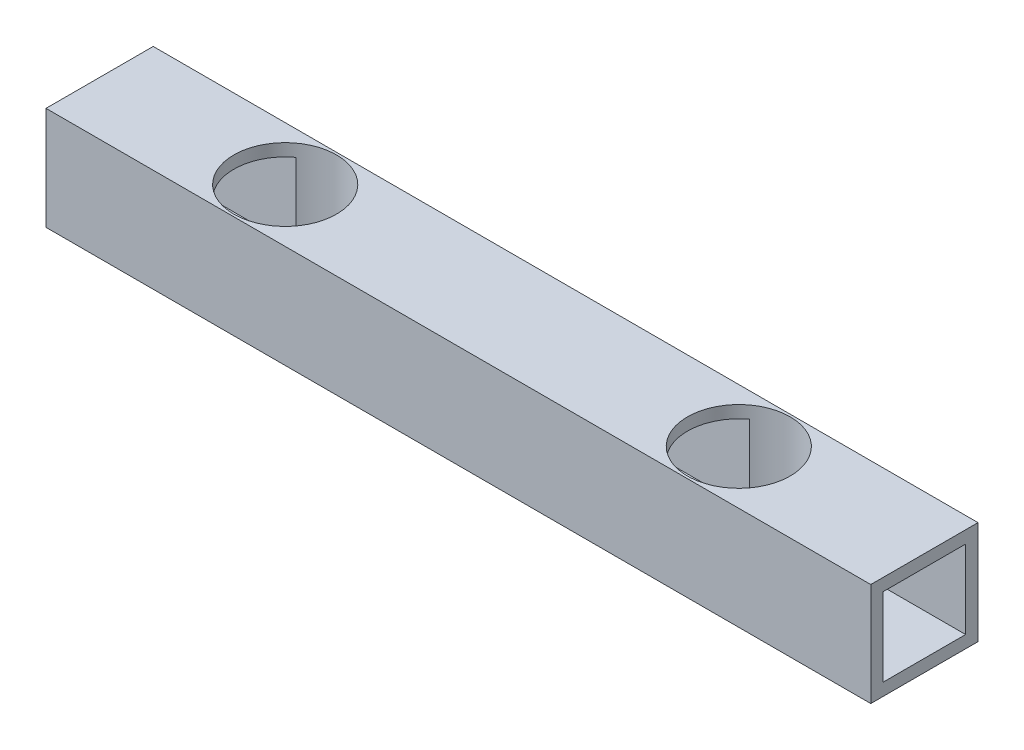
ISO-10303-21;
HEADER;
FILE_DESCRIPTION(('STEP AP214'),'2;1');
FILE_NAME('part.step','',(''),(''),'','','');
FILE_SCHEMA(('AUTOMOTIVE_DESIGN { 1 0 10303 214 1 1 1 1 }'));
ENDSEC;
DATA;
#1=APPLICATION_CONTEXT('core data for automotive mechanical design processes');
#2=APPLICATION_PROTOCOL_DEFINITION('international standard','automotive_design',2000,#1);
#3=PRODUCT_CONTEXT('',#1,'mechanical');
#4=PRODUCT('Part','Part','',(#3));
#5=PRODUCT_RELATED_PRODUCT_CATEGORY('part','',(#4));
#6=PRODUCT_DEFINITION_FORMATION('','',#4);
#7=PRODUCT_DEFINITION_CONTEXT('part definition',#1,'design');
#8=PRODUCT_DEFINITION('design','',#6,#7);
#9=PRODUCT_DEFINITION_SHAPE('','',#8);
#10=(LENGTH_UNIT() NAMED_UNIT(*) SI_UNIT(.MILLI.,.METRE.));
#11=(NAMED_UNIT(*) PLANE_ANGLE_UNIT() SI_UNIT($,.RADIAN.));
#12=(NAMED_UNIT(*) SI_UNIT($,.STERADIAN.) SOLID_ANGLE_UNIT());
#13=UNCERTAINTY_MEASURE_WITH_UNIT(LENGTH_MEASURE(1.E-05),#10,'distance_accuracy_value','');
#14=(GEOMETRIC_REPRESENTATION_CONTEXT(3) GLOBAL_UNCERTAINTY_ASSIGNED_CONTEXT((#13)) GLOBAL_UNIT_ASSIGNED_CONTEXT((#10,
#11,#12)) REPRESENTATION_CONTEXT('',''));
#15=CARTESIAN_POINT('',(0.,0.,0.));
#16=DIRECTION('',(0.,0.,1.));
#17=DIRECTION('',(1.,0.,0.));
#18=AXIS2_PLACEMENT_3D('',#15,#16,#17);
#19=CARTESIAN_POINT('',(-100.,25.,-9.99999999999999));
#20=DIRECTION('',(0.,0.,1.));
#21=DIRECTION('',(1.,0.,0.));
#22=AXIS2_PLACEMENT_3D('',#19,#20,#21);
#23=PLANE('',#22);
#24=DIRECTION('',(0.,1.,0.));
#25=VECTOR('',#24,1.);
#26=CARTESIAN_POINT('',(62.416367035146,0.,-9.99999999999999));
#27=LINE('',#26,#25);
#28=CARTESIAN_POINT('',(62.416367035146,3.,-9.99999999999999));
#29=VERTEX_POINT('',#28);
#30=CARTESIAN_POINT('',(62.416367035146,22.,-9.99999999999999));
#31=VERTEX_POINT('',#30);
#32=EDGE_CURVE('E274',#29,#31,#27,.T.);
#33=ORIENTED_EDGE('',*,*,#32,.F.);
#34=DIRECTION('',(-1.,0.,0.));
#35=VECTOR('',#34,1.);
#36=CARTESIAN_POINT('',(-100.,3.,-9.99999999999999));
#37=LINE('',#36,#35);
#38=CARTESIAN_POINT('',(100.,3.,-9.99999999999999));
#39=VERTEX_POINT('',#38);
#40=EDGE_CURVE('E159',#39,#29,#37,.T.);
#41=ORIENTED_EDGE('',*,*,#40,.F.);
#42=DIRECTION('',(0.,-1.,0.));
#43=VECTOR('',#42,1.);
#44=CARTESIAN_POINT('',(100.,25.,-9.99999999999999));
#45=LINE('',#44,#43);
#46=CARTESIAN_POINT('',(100.,22.,-9.99999999999999));
#47=VERTEX_POINT('',#46);
#48=EDGE_CURVE('E186',#47,#39,#45,.T.);
#49=ORIENTED_EDGE('',*,*,#48,.F.);
#50=DIRECTION('',(-1.,0.,0.));
#51=VECTOR('',#50,1.);
#52=CARTESIAN_POINT('',(-100.,22.,-9.99999999999999));
#53=LINE('',#52,#51);
#54=EDGE_CURVE('E204',#47,#31,#53,.T.);
#55=ORIENTED_EDGE('',*,*,#54,.T.);
#56=EDGE_LOOP('',(#33,#41,#49,#55));
#57=FACE_BOUND('',#56,.T.);
#58=ADVANCED_FACE('F35',(#57),#23,.T.);
#59=CARTESIAN_POINT('',(0.,22.,0.));
#60=DIRECTION('',(0.,1.,0.));
#61=DIRECTION('',(0.,0.,1.));
#62=AXIS2_PLACEMENT_3D('',#59,#60,#61);
#63=PLANE('',#62);
#64=DIRECTION('',(1.,0.,0.));
#65=VECTOR('',#64,1.);
#66=CARTESIAN_POINT('',(-100.,22.,10.));
#67=LINE('',#66,#65);
#68=CARTESIAN_POINT('',(62.4163670351459,22.,10.));
#69=VERTEX_POINT('',#68);
#70=CARTESIAN_POINT('',(100.,22.,10.));
#71=VERTEX_POINT('',#70);
#72=EDGE_CURVE('E202',#69,#71,#67,.T.);
#73=ORIENTED_EDGE('',*,*,#72,.F.);
#74=CARTESIAN_POINT('',(55.,22.,0.));
#75=DIRECTION('',(0.,1.,0.));
#76=DIRECTION('',(0.,0.,1.));
#77=AXIS2_PLACEMENT_3D('',#74,#75,#76);
#78=CIRCLE('',#77,12.45);
#79=EDGE_CURVE('E57',#69,#31,#78,.T.);
#80=ORIENTED_EDGE('',*,*,#79,.T.);
#81=ORIENTED_EDGE('',*,*,#54,.F.);
#82=DIRECTION('',(0.,0.,-1.));
#83=VECTOR('',#82,1.);
#84=CARTESIAN_POINT('',(100.,22.,-13.));
#85=LINE('',#84,#83);
#86=EDGE_CURVE('E190',#71,#47,#85,.T.);
#87=ORIENTED_EDGE('',*,*,#86,.F.);
#88=EDGE_LOOP('',(#73,#80,#81,#87));
#89=FACE_BOUND('',#88,.T.);
#90=ADVANCED_FACE('F327',(#89),#63,.F.);
#91=CARTESIAN_POINT('',(0.,3.,0.));
#92=DIRECTION('',(0.,1.,0.));
#93=DIRECTION('',(0.,0.,1.));
#94=AXIS2_PLACEMENT_3D('',#91,#92,#93);
#95=PLANE('',#94);
#96=CARTESIAN_POINT('',(55.,3.,0.));
#97=DIRECTION('',(0.,1.,0.));
#98=DIRECTION('',(0.,0.,1.));
#99=AXIS2_PLACEMENT_3D('',#96,#97,#98);
#100=CIRCLE('',#99,12.45);
#101=CARTESIAN_POINT('',(62.416367035146,3.,10.));
#102=VERTEX_POINT('',#101);
#103=EDGE_CURVE('E147',#102,#29,#100,.T.);
#104=ORIENTED_EDGE('',*,*,#103,.F.);
#105=DIRECTION('',(1.,0.,0.));
#106=VECTOR('',#105,1.);
#107=CARTESIAN_POINT('',(-100.,3.,10.));
#108=LINE('',#107,#106);
#109=CARTESIAN_POINT('',(100.,3.,10.));
#110=VERTEX_POINT('',#109);
#111=EDGE_CURVE('E156',#102,#110,#108,.T.);
#112=ORIENTED_EDGE('',*,*,#111,.T.);
#113=DIRECTION('',(0.,0.,-1.));
#114=VECTOR('',#113,1.);
#115=CARTESIAN_POINT('',(100.,3.,-13.));
#116=LINE('',#115,#114);
#117=EDGE_CURVE('E177',#110,#39,#116,.T.);
#118=ORIENTED_EDGE('',*,*,#117,.T.);
#119=ORIENTED_EDGE('',*,*,#40,.T.);
#120=EDGE_LOOP('',(#104,#112,#118,#119));
#121=FACE_BOUND('',#120,.T.);
#122=ADVANCED_FACE('F155',(#121),#95,.T.);
#123=CARTESIAN_POINT('',(-100.,25.,10.));
#124=DIRECTION('',(0.,0.,-1.));
#125=DIRECTION('',(-1.,0.,0.));
#126=AXIS2_PLACEMENT_3D('',#123,#124,#125);
#127=PLANE('',#126);
#128=DIRECTION('',(0.,1.,0.));
#129=VECTOR('',#128,1.);
#130=CARTESIAN_POINT('',(47.583632964854,0.,10.));
#131=LINE('',#130,#129);
#132=CARTESIAN_POINT('',(47.583632964854,3.,10.));
#133=VERTEX_POINT('',#132);
#134=CARTESIAN_POINT('',(47.583632964854,22.,10.));
#135=VERTEX_POINT('',#134);
#136=EDGE_CURVE('E11',#133,#135,#131,.T.);
#137=ORIENTED_EDGE('',*,*,#136,.F.);
#138=CARTESIAN_POINT('',(-47.583632964854,3.,10.));
#139=VERTEX_POINT('',#138);
#140=EDGE_CURVE('E166',#139,#133,#108,.T.);
#141=ORIENTED_EDGE('',*,*,#140,.F.);
#142=DIRECTION('',(0.,1.,0.));
#143=VECTOR('',#142,1.);
#144=CARTESIAN_POINT('',(-47.583632964854,0.,10.));
#145=LINE('',#144,#143);
#146=CARTESIAN_POINT('',(-47.583632964854,22.,10.));
#147=VERTEX_POINT('',#146);
#148=EDGE_CURVE('E247',#147,#139,#145,.F.);
#149=ORIENTED_EDGE('',*,*,#148,.F.);
#150=EDGE_CURVE('E471',#147,#135,#67,.T.);
#151=ORIENTED_EDGE('',*,*,#150,.T.);
#152=EDGE_LOOP('',(#137,#141,#149,#151));
#153=FACE_BOUND('',#152,.T.);
#154=ADVANCED_FACE('F323',(#153),#127,.T.);
#155=DIRECTION('',(0.,1.,0.));
#156=VECTOR('',#155,1.);
#157=CARTESIAN_POINT('',(-62.416367035146,0.,10.));
#158=LINE('',#157,#156);
#159=CARTESIAN_POINT('',(-62.416367035146,3.,10.));
#160=VERTEX_POINT('',#159);
#161=CARTESIAN_POINT('',(-62.416367035146,22.,10.));
#162=VERTEX_POINT('',#161);
#163=EDGE_CURVE('E259',#160,#162,#158,.T.);
#164=ORIENTED_EDGE('',*,*,#163,.F.);
#165=CARTESIAN_POINT('',(-100.,3.,10.));
#166=VERTEX_POINT('',#165);
#167=EDGE_CURVE('E169',#166,#160,#108,.T.);
#168=ORIENTED_EDGE('',*,*,#167,.F.);
#169=DIRECTION('',(0.,-1.,0.));
#170=VECTOR('',#169,1.);
#171=CARTESIAN_POINT('',(-100.,25.,10.));
#172=LINE('',#171,#170);
#173=CARTESIAN_POINT('',(-100.,22.,10.));
#174=VERTEX_POINT('',#173);
#175=EDGE_CURVE('E195',#174,#166,#172,.T.);
#176=ORIENTED_EDGE('',*,*,#175,.F.);
#177=EDGE_CURVE('E194',#174,#162,#67,.T.);
#178=ORIENTED_EDGE('',*,*,#177,.T.);
#179=EDGE_LOOP('',(#164,#168,#176,#178));
#180=FACE_BOUND('',#179,.T.);
#181=ADVANCED_FACE('F324',(#180),#127,.T.);
#182=DIRECTION('',(0.,1.,0.));
#183=VECTOR('',#182,1.);
#184=CARTESIAN_POINT('',(47.583632964854,0.,-9.99999999999999));
#185=LINE('',#184,#183);
#186=CARTESIAN_POINT('',(47.583632964854,22.,-9.99999999999999));
#187=VERTEX_POINT('',#186);
#188=CARTESIAN_POINT('',(47.583632964854,3.,-9.99999999999999));
#189=VERTEX_POINT('',#188);
#190=EDGE_CURVE('E269',#187,#189,#185,.F.);
#191=ORIENTED_EDGE('',*,*,#190,.F.);
#192=CARTESIAN_POINT('',(-47.583632964854,22.,-9.99999999999999));
#193=VERTEX_POINT('',#192);
#194=EDGE_CURVE('E255',#187,#193,#53,.T.);
#195=ORIENTED_EDGE('',*,*,#194,.T.);
#196=DIRECTION('',(0.,1.,0.));
#197=VECTOR('',#196,1.);
#198=CARTESIAN_POINT('',(-47.583632964854,0.,-9.99999999999999));
#199=LINE('',#198,#197);
#200=CARTESIAN_POINT('',(-47.583632964854,3.,-9.99999999999999));
#201=VERTEX_POINT('',#200);
#202=EDGE_CURVE('E244',#201,#193,#199,.T.);
#203=ORIENTED_EDGE('',*,*,#202,.F.);
#204=EDGE_CURVE('E182',#189,#201,#37,.T.);
#205=ORIENTED_EDGE('',*,*,#204,.F.);
#206=EDGE_LOOP('',(#191,#195,#203,#205));
#207=FACE_BOUND('',#206,.T.);
#208=ADVANCED_FACE('F253',(#207),#23,.T.);
#209=ORIENTED_EDGE('',*,*,#194,.F.);
#210=EDGE_CURVE('E273',#187,#135,#78,.T.);
#211=ORIENTED_EDGE('',*,*,#210,.T.);
#212=ORIENTED_EDGE('',*,*,#150,.F.);
#213=CARTESIAN_POINT('',(-55.,22.,0.));
#214=DIRECTION('',(0.,1.,0.));
#215=DIRECTION('',(0.,0.,1.));
#216=AXIS2_PLACEMENT_3D('',#213,#214,#215);
#217=CIRCLE('',#216,12.45);
#218=EDGE_CURVE('E172',#147,#193,#217,.T.);
#219=ORIENTED_EDGE('',*,*,#218,.T.);
#220=EDGE_LOOP('',(#209,#211,#212,#219));
#221=FACE_BOUND('',#220,.T.);
#222=ADVANCED_FACE('F335',(#221),#63,.F.);
#223=EDGE_CURVE('E49',#189,#133,#100,.T.);
#224=ORIENTED_EDGE('',*,*,#223,.F.);
#225=ORIENTED_EDGE('',*,*,#204,.T.);
#226=CARTESIAN_POINT('',(-55.,3.,0.));
#227=DIRECTION('',(0.,1.,0.));
#228=DIRECTION('',(0.,0.,1.));
#229=AXIS2_PLACEMENT_3D('',#226,#227,#228);
#230=CIRCLE('',#229,12.45);
#231=EDGE_CURVE('E152',#139,#201,#230,.T.);
#232=ORIENTED_EDGE('',*,*,#231,.F.);
#233=ORIENTED_EDGE('',*,*,#140,.T.);
#234=EDGE_LOOP('',(#224,#225,#232,#233));
#235=FACE_BOUND('',#234,.T.);
#236=ADVANCED_FACE('F361',(#235),#95,.T.);
#237=CARTESIAN_POINT('',(-100.,25.,-13.));
#238=DIRECTION('',(1.,0.,0.));
#239=DIRECTION('',(0.,0.,-1.));
#240=AXIS2_PLACEMENT_3D('',#237,#238,#239);
#241=PLANE('',#240);
#242=DIRECTION('',(0.,0.,1.));
#243=VECTOR('',#242,1.);
#244=CARTESIAN_POINT('',(-100.,0.,-13.));
#245=LINE('',#244,#243);
#246=CARTESIAN_POINT('',(-100.,0.,-13.));
#247=VERTEX_POINT('',#246);
#248=CARTESIAN_POINT('',(-100.,0.,13.));
#249=VERTEX_POINT('',#248);
#250=EDGE_CURVE('E198',#247,#249,#245,.T.);
#251=ORIENTED_EDGE('',*,*,#250,.T.);
#252=DIRECTION('',(0.,-1.,0.));
#253=VECTOR('',#252,1.);
#254=CARTESIAN_POINT('',(-100.,25.,13.));
#255=LINE('',#254,#253);
#256=CARTESIAN_POINT('',(-100.,25.,13.));
#257=VERTEX_POINT('',#256);
#258=EDGE_CURVE('E232',#257,#249,#255,.T.);
#259=ORIENTED_EDGE('',*,*,#258,.F.);
#260=DIRECTION('',(0.,0.,1.));
#261=VECTOR('',#260,1.);
#262=CARTESIAN_POINT('',(-100.,25.,-13.));
#263=LINE('',#262,#261);
#264=CARTESIAN_POINT('',(-100.,25.,-13.));
#265=VERTEX_POINT('',#264);
#266=EDGE_CURVE('E206',#265,#257,#263,.T.);
#267=ORIENTED_EDGE('',*,*,#266,.F.);
#268=DIRECTION('',(0.,-1.,0.));
#269=VECTOR('',#268,1.);
#270=CARTESIAN_POINT('',(-100.,25.,-13.));
#271=LINE('',#270,#269);
#272=EDGE_CURVE('E216',#265,#247,#271,.T.);
#273=ORIENTED_EDGE('',*,*,#272,.T.);
#274=EDGE_LOOP('',(#251,#259,#267,#273));
#275=FACE_BOUND('',#274,.T.);
#276=DIRECTION('',(0.,0.,1.));
#277=VECTOR('',#276,1.);
#278=CARTESIAN_POINT('',(-100.,3.,-13.));
#279=LINE('',#278,#277);
#280=CARTESIAN_POINT('',(-100.,3.,-9.99999999999999));
#281=VERTEX_POINT('',#280);
#282=EDGE_CURVE('E167',#281,#166,#279,.T.);
#283=ORIENTED_EDGE('',*,*,#282,.F.);
#284=DIRECTION('',(0.,-1.,0.));
#285=VECTOR('',#284,1.);
#286=CARTESIAN_POINT('',(-100.,25.,-9.99999999999999));
#287=LINE('',#286,#285);
#288=CARTESIAN_POINT('',(-100.,22.,-9.99999999999999));
#289=VERTEX_POINT('',#288);
#290=EDGE_CURVE('E189',#289,#281,#287,.T.);
#291=ORIENTED_EDGE('',*,*,#290,.F.);
#292=DIRECTION('',(0.,0.,1.));
#293=VECTOR('',#292,1.);
#294=CARTESIAN_POINT('',(-100.,22.,-13.));
#295=LINE('',#294,#293);
#296=EDGE_CURVE('E199',#289,#174,#295,.T.);
#297=ORIENTED_EDGE('',*,*,#296,.T.);
#298=ORIENTED_EDGE('',*,*,#175,.T.);
#299=EDGE_LOOP('',(#283,#291,#297,#298));
#300=FACE_BOUND('',#299,.T.);
#301=ADVANCED_FACE('F37',(#275,#300),#241,.F.);
#302=CARTESIAN_POINT('',(100.,25.,-13.));
#303=DIRECTION('',(-1.,0.,0.));
#304=DIRECTION('',(0.,0.,1.));
#305=AXIS2_PLACEMENT_3D('',#302,#303,#304);
#306=PLANE('',#305);
#307=DIRECTION('',(0.,0.,-1.));
#308=VECTOR('',#307,1.);
#309=CARTESIAN_POINT('',(100.,0.,-13.));
#310=LINE('',#309,#308);
#311=CARTESIAN_POINT('',(100.,0.,13.));
#312=VERTEX_POINT('',#311);
#313=CARTESIAN_POINT('',(100.,0.,-13.));
#314=VERTEX_POINT('',#313);
#315=EDGE_CURVE('E221',#312,#314,#310,.T.);
#316=ORIENTED_EDGE('',*,*,#315,.T.);
#317=DIRECTION('',(0.,-1.,0.));
#318=VECTOR('',#317,1.);
#319=CARTESIAN_POINT('',(100.,25.,-13.));
#320=LINE('',#319,#318);
#321=CARTESIAN_POINT('',(100.,25.,-13.));
#322=VERTEX_POINT('',#321);
#323=EDGE_CURVE('E226',#322,#314,#320,.T.);
#324=ORIENTED_EDGE('',*,*,#323,.F.);
#325=DIRECTION('',(0.,0.,-1.));
#326=VECTOR('',#325,1.);
#327=CARTESIAN_POINT('',(100.,25.,-13.));
#328=LINE('',#327,#326);
#329=CARTESIAN_POINT('',(100.,25.,13.));
#330=VERTEX_POINT('',#329);
#331=EDGE_CURVE('E212',#330,#322,#328,.T.);
#332=ORIENTED_EDGE('',*,*,#331,.F.);
#333=DIRECTION('',(0.,-1.,0.));
#334=VECTOR('',#333,1.);
#335=CARTESIAN_POINT('',(100.,25.,13.));
#336=LINE('',#335,#334);
#337=EDGE_CURVE('E229',#330,#312,#336,.T.);
#338=ORIENTED_EDGE('',*,*,#337,.T.);
#339=EDGE_LOOP('',(#316,#324,#332,#338));
#340=FACE_BOUND('',#339,.T.);
#341=ORIENTED_EDGE('',*,*,#117,.F.);
#342=DIRECTION('',(0.,-1.,0.));
#343=VECTOR('',#342,1.);
#344=CARTESIAN_POINT('',(100.,25.,10.));
#345=LINE('',#344,#343);
#346=EDGE_CURVE('E164',#71,#110,#345,.T.);
#347=ORIENTED_EDGE('',*,*,#346,.F.);
#348=ORIENTED_EDGE('',*,*,#86,.T.);
#349=ORIENTED_EDGE('',*,*,#48,.T.);
#350=EDGE_LOOP('',(#341,#347,#348,#349));
#351=FACE_BOUND('',#350,.T.);
#352=ADVANCED_FACE('F311',(#340,#351),#306,.F.);
#353=CARTESIAN_POINT('',(-100.,25.,13.));
#354=DIRECTION('',(0.,0.,-1.));
#355=DIRECTION('',(-1.,0.,0.));
#356=AXIS2_PLACEMENT_3D('',#353,#354,#355);
#357=PLANE('',#356);
#358=DIRECTION('',(1.,0.,0.));
#359=VECTOR('',#358,1.);
#360=CARTESIAN_POINT('',(-100.,0.,13.));
#361=LINE('',#360,#359);
#362=EDGE_CURVE('E219',#249,#312,#361,.T.);
#363=ORIENTED_EDGE('',*,*,#362,.T.);
#364=ORIENTED_EDGE('',*,*,#337,.F.);
#365=DIRECTION('',(1.,0.,0.));
#366=VECTOR('',#365,1.);
#367=CARTESIAN_POINT('',(-100.,25.,13.));
#368=LINE('',#367,#366);
#369=EDGE_CURVE('E209',#257,#330,#368,.T.);
#370=ORIENTED_EDGE('',*,*,#369,.F.);
#371=ORIENTED_EDGE('',*,*,#258,.T.);
#372=EDGE_LOOP('',(#363,#364,#370,#371));
#373=FACE_BOUND('',#372,.T.);
#374=ADVANCED_FACE('F306',(#373),#357,.F.);
#375=CARTESIAN_POINT('',(-100.,25.,-13.));
#376=DIRECTION('',(0.,0.,1.));
#377=DIRECTION('',(1.,0.,0.));
#378=AXIS2_PLACEMENT_3D('',#375,#376,#377);
#379=PLANE('',#378);
#380=DIRECTION('',(-1.,0.,0.));
#381=VECTOR('',#380,1.);
#382=CARTESIAN_POINT('',(-100.,0.,-13.));
#383=LINE('',#382,#381);
#384=EDGE_CURVE('E210',#314,#247,#383,.T.);
#385=ORIENTED_EDGE('',*,*,#384,.T.);
#386=ORIENTED_EDGE('',*,*,#272,.F.);
#387=DIRECTION('',(-1.,0.,0.));
#388=VECTOR('',#387,1.);
#389=CARTESIAN_POINT('',(-100.,25.,-13.));
#390=LINE('',#389,#388);
#391=EDGE_CURVE('E214',#322,#265,#390,.T.);
#392=ORIENTED_EDGE('',*,*,#391,.F.);
#393=ORIENTED_EDGE('',*,*,#323,.T.);
#394=EDGE_LOOP('',(#385,#386,#392,#393));
#395=FACE_BOUND('',#394,.T.);
#396=ADVANCED_FACE('F293',(#395),#379,.F.);
#397=CARTESIAN_POINT('',(0.,25.,0.));
#398=DIRECTION('',(0.,1.,0.));
#399=DIRECTION('',(0.,0.,1.));
#400=AXIS2_PLACEMENT_3D('',#397,#398,#399);
#401=PLANE('',#400);
#402=CARTESIAN_POINT('',(55.,25.,0.));
#403=DIRECTION('',(0.,1.,0.));
#404=DIRECTION('',(0.,0.,-1.));
#405=AXIS2_PLACEMENT_3D('',#402,#403,#404);
#406=CIRCLE('',#405,12.45);
#407=CARTESIAN_POINT('',(55.,25.,-12.45));
#408=VERTEX_POINT('',#407);
#409=EDGE_CURVE('E277',#408,#408,#406,.T.);
#410=ORIENTED_EDGE('',*,*,#409,.F.);
#411=EDGE_LOOP('',(#410));
#412=FACE_BOUND('',#411,.T.);
#413=CARTESIAN_POINT('',(-55.,25.,0.));
#414=DIRECTION('',(0.,1.,0.));
#415=DIRECTION('',(0.,0.,1.));
#416=AXIS2_PLACEMENT_3D('',#413,#414,#415);
#417=CIRCLE('',#416,12.45);
#418=CARTESIAN_POINT('',(-55.,25.,12.45));
#419=VERTEX_POINT('',#418);
#420=EDGE_CURVE('E266',#419,#419,#417,.T.);
#421=ORIENTED_EDGE('',*,*,#420,.F.);
#422=EDGE_LOOP('',(#421));
#423=FACE_BOUND('',#422,.T.);
#424=ORIENTED_EDGE('',*,*,#266,.T.);
#425=ORIENTED_EDGE('',*,*,#369,.T.);
#426=ORIENTED_EDGE('',*,*,#331,.T.);
#427=ORIENTED_EDGE('',*,*,#391,.T.);
#428=EDGE_LOOP('',(#424,#425,#426,#427));
#429=FACE_BOUND('',#428,.T.);
#430=ADVANCED_FACE('F290',(#412,#423,#429),#401,.T.);
#431=CARTESIAN_POINT('',(0.,0.,0.));
#432=DIRECTION('',(0.,1.,0.));
#433=DIRECTION('',(0.,0.,1.));
#434=AXIS2_PLACEMENT_3D('',#431,#432,#433);
#435=PLANE('',#434);
#436=CARTESIAN_POINT('',(55.,0.,0.));
#437=DIRECTION('',(0.,1.,0.));
#438=DIRECTION('',(0.,0.,-1.));
#439=AXIS2_PLACEMENT_3D('',#436,#437,#438);
#440=CIRCLE('',#439,12.45);
#441=CARTESIAN_POINT('',(55.,0.,-12.45));
#442=VERTEX_POINT('',#441);
#443=EDGE_CURVE('E160',#442,#442,#440,.T.);
#444=ORIENTED_EDGE('',*,*,#443,.T.);
#445=EDGE_LOOP('',(#444));
#446=FACE_BOUND('',#445,.T.);
#447=CARTESIAN_POINT('',(-55.,0.,0.));
#448=DIRECTION('',(0.,1.,0.));
#449=DIRECTION('',(0.,0.,1.));
#450=AXIS2_PLACEMENT_3D('',#447,#448,#449);
#451=CIRCLE('',#450,12.45);
#452=CARTESIAN_POINT('',(-55.,0.,12.45));
#453=VERTEX_POINT('',#452);
#454=EDGE_CURVE('E265',#453,#453,#451,.T.);
#455=ORIENTED_EDGE('',*,*,#454,.T.);
#456=EDGE_LOOP('',(#455));
#457=FACE_BOUND('',#456,.T.);
#458=ORIENTED_EDGE('',*,*,#250,.F.);
#459=ORIENTED_EDGE('',*,*,#384,.F.);
#460=ORIENTED_EDGE('',*,*,#315,.F.);
#461=ORIENTED_EDGE('',*,*,#362,.F.);
#462=EDGE_LOOP('',(#458,#459,#460,#461));
#463=FACE_BOUND('',#462,.T.);
#464=ADVANCED_FACE('F283',(#446,#457,#463),#435,.F.);
#465=DIRECTION('',(0.,1.,0.));
#466=VECTOR('',#465,1.);
#467=CARTESIAN_POINT('',(62.416367035146,0.,10.));
#468=LINE('',#467,#466);
#469=EDGE_CURVE('E43',#69,#102,#468,.F.);
#470=ORIENTED_EDGE('',*,*,#469,.F.);
#471=ORIENTED_EDGE('',*,*,#72,.T.);
#472=ORIENTED_EDGE('',*,*,#346,.T.);
#473=ORIENTED_EDGE('',*,*,#111,.F.);
#474=EDGE_LOOP('',(#470,#471,#472,#473));
#475=FACE_BOUND('',#474,.T.);
#476=ADVANCED_FACE('F162',(#475),#127,.T.);
#477=DIRECTION('',(0.,1.,0.));
#478=VECTOR('',#477,1.);
#479=CARTESIAN_POINT('',(-62.416367035146,0.,-9.99999999999999));
#480=LINE('',#479,#478);
#481=CARTESIAN_POINT('',(-62.416367035146,22.,-9.99999999999999));
#482=VERTEX_POINT('',#481);
#483=CARTESIAN_POINT('',(-62.416367035146,3.,-9.99999999999999));
#484=VERTEX_POINT('',#483);
#485=EDGE_CURVE('E263',#482,#484,#480,.F.);
#486=ORIENTED_EDGE('',*,*,#485,.F.);
#487=EDGE_CURVE('E193',#482,#289,#53,.T.);
#488=ORIENTED_EDGE('',*,*,#487,.T.);
#489=ORIENTED_EDGE('',*,*,#290,.T.);
#490=EDGE_CURVE('E180',#484,#281,#37,.T.);
#491=ORIENTED_EDGE('',*,*,#490,.F.);
#492=EDGE_LOOP('',(#486,#488,#489,#491));
#493=FACE_BOUND('',#492,.T.);
#494=ADVANCED_FACE('F321',(#493),#23,.T.);
#495=ORIENTED_EDGE('',*,*,#487,.F.);
#496=EDGE_CURVE('E256',#482,#162,#217,.T.);
#497=ORIENTED_EDGE('',*,*,#496,.T.);
#498=ORIENTED_EDGE('',*,*,#177,.F.);
#499=ORIENTED_EDGE('',*,*,#296,.F.);
#500=EDGE_LOOP('',(#495,#497,#498,#499));
#501=FACE_BOUND('',#500,.T.);
#502=ADVANCED_FACE('F336',(#501),#63,.F.);
#503=EDGE_CURVE('E235',#484,#160,#230,.T.);
#504=ORIENTED_EDGE('',*,*,#503,.F.);
#505=ORIENTED_EDGE('',*,*,#490,.T.);
#506=ORIENTED_EDGE('',*,*,#282,.T.);
#507=ORIENTED_EDGE('',*,*,#167,.T.);
#508=EDGE_LOOP('',(#504,#505,#506,#507));
#509=FACE_BOUND('',#508,.T.);
#510=ADVANCED_FACE('F343',(#509),#95,.T.);
#511=CARTESIAN_POINT('',(-55.,0.,0.));
#512=DIRECTION('',(0.,1.,0.));
#513=DIRECTION('',(0.,0.,1.));
#514=AXIS2_PLACEMENT_3D('',#511,#512,#513);
#515=CYLINDRICAL_SURFACE('',#514,12.45);
#516=ORIENTED_EDGE('',*,*,#485,.T.);
#517=ORIENTED_EDGE('',*,*,#503,.T.);
#518=ORIENTED_EDGE('',*,*,#163,.T.);
#519=ORIENTED_EDGE('',*,*,#496,.F.);
#520=EDGE_LOOP('',(#516,#517,#518,#519));
#521=FACE_BOUND('',#520,.T.);
#522=ORIENTED_EDGE('',*,*,#454,.F.);
#523=EDGE_LOOP('',(#522));
#524=FACE_BOUND('',#523,.T.);
#525=ORIENTED_EDGE('',*,*,#420,.T.);
#526=EDGE_LOOP('',(#525));
#527=FACE_BOUND('',#526,.T.);
#528=ORIENTED_EDGE('',*,*,#148,.T.);
#529=ORIENTED_EDGE('',*,*,#231,.T.);
#530=ORIENTED_EDGE('',*,*,#202,.T.);
#531=ORIENTED_EDGE('',*,*,#218,.F.);
#532=EDGE_LOOP('',(#528,#529,#530,#531));
#533=FACE_BOUND('',#532,.T.);
#534=ADVANCED_FACE('F243',(#521,#524,#527,#533),#515,.F.);
#535=CARTESIAN_POINT('',(55.,0.,0.));
#536=DIRECTION('',(0.,1.,0.));
#537=DIRECTION('',(0.,0.,1.));
#538=AXIS2_PLACEMENT_3D('',#535,#536,#537);
#539=CYLINDRICAL_SURFACE('',#538,12.45);
#540=ORIENTED_EDGE('',*,*,#190,.T.);
#541=ORIENTED_EDGE('',*,*,#223,.T.);
#542=ORIENTED_EDGE('',*,*,#136,.T.);
#543=ORIENTED_EDGE('',*,*,#210,.F.);
#544=EDGE_LOOP('',(#540,#541,#542,#543));
#545=FACE_BOUND('',#544,.T.);
#546=ORIENTED_EDGE('',*,*,#32,.T.);
#547=ORIENTED_EDGE('',*,*,#79,.F.);
#548=ORIENTED_EDGE('',*,*,#469,.T.);
#549=ORIENTED_EDGE('',*,*,#103,.T.);
#550=EDGE_LOOP('',(#546,#547,#548,#549));
#551=FACE_BOUND('',#550,.T.);
#552=ORIENTED_EDGE('',*,*,#443,.F.);
#553=EDGE_LOOP('',(#552));
#554=FACE_BOUND('',#553,.T.);
#555=ORIENTED_EDGE('',*,*,#409,.T.);
#556=EDGE_LOOP('',(#555));
#557=FACE_BOUND('',#556,.T.);
#558=ADVANCED_FACE('F145',(#545,#551,#554,#557),#539,.F.);
#559=CLOSED_SHELL('',(#58,#90,#122,#154,#181,#208,#222,#236,#301,#352,#374,#396,#430,#464,#476,
#494,#502,#510,#534,#558));
#560=MANIFOLD_SOLID_BREP('B2',#559);
#561=ADVANCED_BREP_SHAPE_REPRESENTATION('',(#18,#560),#14);
#562=SHAPE_DEFINITION_REPRESENTATION(#9,#561);
ENDSEC;
END-ISO-10303-21;
